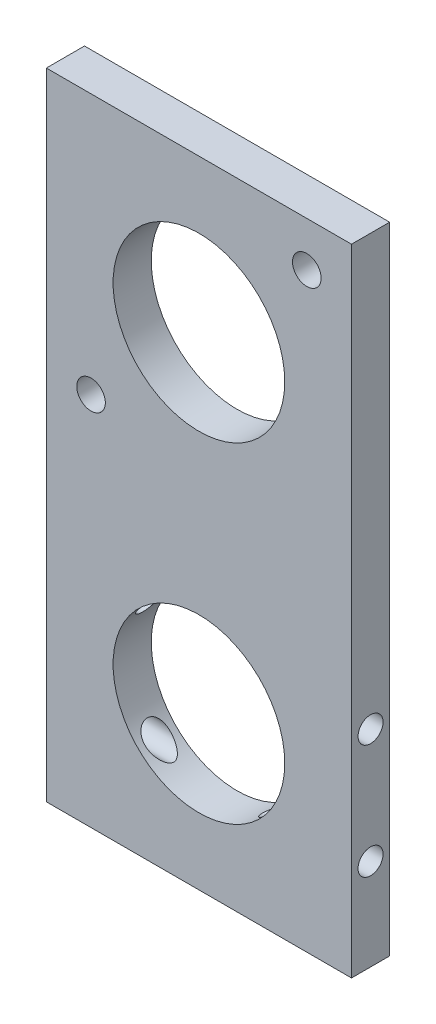
ISO-10303-21;
HEADER;
FILE_DESCRIPTION(('STEP AP214'),'2;1');
FILE_NAME('part.step','',(''),(''),'','','');
FILE_SCHEMA(('AUTOMOTIVE_DESIGN { 1 0 10303 214 1 1 1 1 }'));
ENDSEC;
DATA;
#1=APPLICATION_CONTEXT('core data for automotive mechanical design processes');
#2=APPLICATION_PROTOCOL_DEFINITION('international standard','automotive_design',2000,#1);
#3=PRODUCT_CONTEXT('',#1,'mechanical');
#4=PRODUCT('Part','Part','',(#3));
#5=PRODUCT_RELATED_PRODUCT_CATEGORY('part','',(#4));
#6=PRODUCT_DEFINITION_FORMATION('','',#4);
#7=PRODUCT_DEFINITION_CONTEXT('part definition',#1,'design');
#8=PRODUCT_DEFINITION('design','',#6,#7);
#9=PRODUCT_DEFINITION_SHAPE('','',#8);
#10=(LENGTH_UNIT() NAMED_UNIT(*) SI_UNIT(.MILLI.,.METRE.));
#11=(NAMED_UNIT(*) PLANE_ANGLE_UNIT() SI_UNIT($,.RADIAN.));
#12=(NAMED_UNIT(*) SI_UNIT($,.STERADIAN.) SOLID_ANGLE_UNIT());
#13=UNCERTAINTY_MEASURE_WITH_UNIT(LENGTH_MEASURE(1.E-05),#10,'distance_accuracy_value','');
#14=(GEOMETRIC_REPRESENTATION_CONTEXT(3) GLOBAL_UNCERTAINTY_ASSIGNED_CONTEXT((#13)) GLOBAL_UNIT_ASSIGNED_CONTEXT((#10,
#11,#12)) REPRESENTATION_CONTEXT('',''));
#15=CARTESIAN_POINT('',(0.,0.,0.));
#16=DIRECTION('',(0.,0.,1.));
#17=DIRECTION('',(1.,0.,0.));
#18=AXIS2_PLACEMENT_3D('',#15,#16,#17);
#19=CARTESIAN_POINT('',(0.,0.,6.35));
#20=DIRECTION('',(0.,0.,-1.));
#21=DIRECTION('',(-1.,0.,0.));
#22=AXIS2_PLACEMENT_3D('',#19,#20,#21);
#23=PLANE('',#22);
#24=DIRECTION('',(0.,-1.,0.));
#25=VECTOR('',#24,1.);
#26=CARTESIAN_POINT('',(-25.4,25.4,6.35));
#27=LINE('',#26,#25);
#28=CARTESIAN_POINT('',(-25.4,25.4,6.35));
#29=VERTEX_POINT('',#28);
#30=CARTESIAN_POINT('',(-25.4,-80.399998966,6.35));
#31=VERTEX_POINT('',#30);
#32=EDGE_CURVE('E94',#29,#31,#27,.T.);
#33=ORIENTED_EDGE('',*,*,#32,.T.);
#34=DIRECTION('',(1.,0.,0.));
#35=VECTOR('',#34,1.);
#36=CARTESIAN_POINT('',(25.4,-80.399998966,6.35));
#37=LINE('',#36,#35);
#38=CARTESIAN_POINT('',(25.4,-80.399998966,6.35));
#39=VERTEX_POINT('',#38);
#40=EDGE_CURVE('E89',#31,#39,#37,.T.);
#41=ORIENTED_EDGE('',*,*,#40,.T.);
#42=DIRECTION('',(0.,1.,0.));
#43=VECTOR('',#42,1.);
#44=CARTESIAN_POINT('',(25.4,25.4,6.35));
#45=LINE('',#44,#43);
#46=CARTESIAN_POINT('',(25.4,25.4,6.35));
#47=VERTEX_POINT('',#46);
#48=EDGE_CURVE('E92',#39,#47,#45,.T.);
#49=ORIENTED_EDGE('',*,*,#48,.T.);
#50=DIRECTION('',(-1.,0.,0.));
#51=VECTOR('',#50,1.);
#52=CARTESIAN_POINT('',(25.4,25.4,6.35));
#53=LINE('',#52,#51);
#54=EDGE_CURVE('E59',#47,#29,#53,.T.);
#55=ORIENTED_EDGE('',*,*,#54,.T.);
#56=EDGE_LOOP('',(#33,#41,#49,#55));
#57=FACE_BOUND('',#56,.T.);
#58=CARTESIAN_POINT('',(-17.9605122421383,-17.9605122421383,6.35));
#59=DIRECTION('',(0.,0.,1.));
#60=DIRECTION('',(1.,0.,0.));
#61=AXIS2_PLACEMENT_3D('',#58,#59,#60);
#62=CIRCLE('',#61,2.38125);
#63=CARTESIAN_POINT('',(-15.5792622421383,-17.9605122421383,6.35));
#64=VERTEX_POINT('',#63);
#65=EDGE_CURVE('E110',#64,#64,#62,.T.);
#66=ORIENTED_EDGE('',*,*,#65,.F.);
#67=EDGE_LOOP('',(#66));
#68=FACE_BOUND('',#67,.T.);
#69=CARTESIAN_POINT('',(0.,0.,6.35));
#70=DIRECTION('',(0.,0.,1.));
#71=DIRECTION('',(1.,0.,0.));
#72=AXIS2_PLACEMENT_3D('',#69,#70,#71);
#73=CIRCLE('',#72,14.2875);
#74=CARTESIAN_POINT('',(14.2875,0.,6.35));
#75=VERTEX_POINT('',#74);
#76=EDGE_CURVE('E180',#75,#75,#73,.T.);
#77=ORIENTED_EDGE('',*,*,#76,.F.);
#78=EDGE_LOOP('',(#77));
#79=FACE_BOUND('',#78,.T.);
#80=CARTESIAN_POINT('',(17.9605122421383,17.9605122421383,6.35));
#81=DIRECTION('',(0.,0.,1.));
#82=DIRECTION('',(1.,0.,0.));
#83=AXIS2_PLACEMENT_3D('',#80,#81,#82);
#84=CIRCLE('',#83,2.38125);
#85=CARTESIAN_POINT('',(20.3417622421383,17.9605122421383,6.35));
#86=VERTEX_POINT('',#85);
#87=EDGE_CURVE('E174',#86,#86,#84,.T.);
#88=ORIENTED_EDGE('',*,*,#87,.F.);
#89=EDGE_LOOP('',(#88));
#90=FACE_BOUND('',#89,.T.);
#91=CARTESIAN_POINT('',(0.,-54.999998966,6.35));
#92=DIRECTION('',(0.,0.,1.));
#93=DIRECTION('',(1.,0.,0.));
#94=AXIS2_PLACEMENT_3D('',#91,#92,#93);
#95=CIRCLE('',#94,14.2875);
#96=CARTESIAN_POINT('',(14.2875,-54.999998966,6.35));
#97=VERTEX_POINT('',#96);
#98=EDGE_CURVE('E165',#97,#97,#95,.T.);
#99=ORIENTED_EDGE('',*,*,#98,.F.);
#100=EDGE_LOOP('',(#99));
#101=FACE_BOUND('',#100,.T.);
#102=ADVANCED_FACE('F35',(#57,#68,#79,#90,#101),#23,.F.);
#103=CARTESIAN_POINT('',(0.,0.,0.));
#104=DIRECTION('',(0.,0.,-1.));
#105=DIRECTION('',(-1.,0.,0.));
#106=AXIS2_PLACEMENT_3D('',#103,#104,#105);
#107=PLANE('',#106);
#108=CARTESIAN_POINT('',(17.9605122421383,17.9605122421383,0.));
#109=DIRECTION('',(0.,0.,1.));
#110=DIRECTION('',(1.,0.,0.));
#111=AXIS2_PLACEMENT_3D('',#108,#109,#110);
#112=CIRCLE('',#111,2.38125);
#113=CARTESIAN_POINT('',(20.3417622421383,17.9605122421383,0.));
#114=VERTEX_POINT('',#113);
#115=EDGE_CURVE('E170',#114,#114,#112,.T.);
#116=ORIENTED_EDGE('',*,*,#115,.T.);
#117=EDGE_LOOP('',(#116));
#118=FACE_BOUND('',#117,.T.);
#119=CARTESIAN_POINT('',(-17.9605122421383,-17.9605122421383,0.));
#120=DIRECTION('',(0.,0.,1.));
#121=DIRECTION('',(1.,0.,0.));
#122=AXIS2_PLACEMENT_3D('',#119,#120,#121);
#123=CIRCLE('',#122,2.38125);
#124=CARTESIAN_POINT('',(-15.5792622421383,-17.9605122421383,0.));
#125=VERTEX_POINT('',#124);
#126=EDGE_CURVE('E183',#125,#125,#123,.T.);
#127=ORIENTED_EDGE('',*,*,#126,.T.);
#128=EDGE_LOOP('',(#127));
#129=FACE_BOUND('',#128,.T.);
#130=DIRECTION('',(0.,-1.,0.));
#131=VECTOR('',#130,1.);
#132=CARTESIAN_POINT('',(-25.4,25.4,0.));
#133=LINE('',#132,#131);
#134=CARTESIAN_POINT('',(-25.4,25.4,0.));
#135=VERTEX_POINT('',#134);
#136=CARTESIAN_POINT('',(-25.4,-80.399998966,0.));
#137=VERTEX_POINT('',#136);
#138=EDGE_CURVE('E107',#135,#137,#133,.T.);
#139=ORIENTED_EDGE('',*,*,#138,.F.);
#140=DIRECTION('',(-1.,0.,0.));
#141=VECTOR('',#140,1.);
#142=CARTESIAN_POINT('',(25.4,25.4,0.));
#143=LINE('',#142,#141);
#144=CARTESIAN_POINT('',(25.4,25.4,0.));
#145=VERTEX_POINT('',#144);
#146=EDGE_CURVE('E82',#145,#135,#143,.T.);
#147=ORIENTED_EDGE('',*,*,#146,.F.);
#148=DIRECTION('',(0.,1.,0.));
#149=VECTOR('',#148,1.);
#150=CARTESIAN_POINT('',(25.4,25.4,0.));
#151=LINE('',#150,#149);
#152=CARTESIAN_POINT('',(25.4,-80.399998966,0.));
#153=VERTEX_POINT('',#152);
#154=EDGE_CURVE('E76',#153,#145,#151,.T.);
#155=ORIENTED_EDGE('',*,*,#154,.F.);
#156=DIRECTION('',(1.,0.,0.));
#157=VECTOR('',#156,1.);
#158=CARTESIAN_POINT('',(25.4,-80.399998966,0.));
#159=LINE('',#158,#157);
#160=EDGE_CURVE('E98',#137,#153,#159,.T.);
#161=ORIENTED_EDGE('',*,*,#160,.F.);
#162=EDGE_LOOP('',(#139,#147,#155,#161));
#163=FACE_BOUND('',#162,.T.);
#164=CARTESIAN_POINT('',(0.,0.,0.));
#165=DIRECTION('',(0.,0.,1.));
#166=DIRECTION('',(1.,0.,0.));
#167=AXIS2_PLACEMENT_3D('',#164,#165,#166);
#168=CIRCLE('',#167,14.2875);
#169=CARTESIAN_POINT('',(14.2875,0.,0.));
#170=VERTEX_POINT('',#169);
#171=EDGE_CURVE('E177',#170,#170,#168,.T.);
#172=ORIENTED_EDGE('',*,*,#171,.T.);
#173=EDGE_LOOP('',(#172));
#174=FACE_BOUND('',#173,.T.);
#175=CARTESIAN_POINT('',(0.,-54.999998966,0.));
#176=DIRECTION('',(0.,0.,1.));
#177=DIRECTION('',(1.,0.,0.));
#178=AXIS2_PLACEMENT_3D('',#175,#176,#177);
#179=CIRCLE('',#178,14.2875);
#180=CARTESIAN_POINT('',(14.2875,-54.999998966,0.));
#181=VERTEX_POINT('',#180);
#182=EDGE_CURVE('E150',#181,#181,#179,.T.);
#183=ORIENTED_EDGE('',*,*,#182,.T.);
#184=EDGE_LOOP('',(#183));
#185=FACE_BOUND('',#184,.T.);
#186=ADVANCED_FACE('F191',(#118,#129,#163,#174,#185),#107,.T.);
#187=CARTESIAN_POINT('',(-25.4,25.4,6.35));
#188=DIRECTION('',(1.,0.,0.));
#189=DIRECTION('',(0.,1.,0.));
#190=AXIS2_PLACEMENT_3D('',#187,#188,#189);
#191=PLANE('',#190);
#192=CARTESIAN_POINT('',(-25.4,-65.159998966,3.175));
#193=DIRECTION('',(1.,0.,0.));
#194=DIRECTION('',(0.,1.,0.));
#195=AXIS2_PLACEMENT_3D('',#192,#193,#194);
#196=CIRCLE('',#195,2.0828);
#197=CARTESIAN_POINT('',(-25.4,-63.077198966,3.175));
#198=VERTEX_POINT('',#197);
#199=EDGE_CURVE('E124',#198,#198,#196,.T.);
#200=ORIENTED_EDGE('',*,*,#199,.T.);
#201=EDGE_LOOP('',(#200));
#202=FACE_BOUND('',#201,.T.);
#203=CARTESIAN_POINT('',(-25.4,-46.109998966,3.175));
#204=DIRECTION('',(1.,0.,0.));
#205=DIRECTION('',(0.,1.,0.));
#206=AXIS2_PLACEMENT_3D('',#203,#204,#205);
#207=CIRCLE('',#206,2.0828);
#208=CARTESIAN_POINT('',(-25.4,-44.027198966,3.175));
#209=VERTEX_POINT('',#208);
#210=EDGE_CURVE('E230',#209,#209,#207,.T.);
#211=ORIENTED_EDGE('',*,*,#210,.T.);
#212=EDGE_LOOP('',(#211));
#213=FACE_BOUND('',#212,.T.);
#214=ORIENTED_EDGE('',*,*,#138,.T.);
#215=DIRECTION('',(0.,0.,-1.));
#216=VECTOR('',#215,1.);
#217=CARTESIAN_POINT('',(-25.4,-80.399998966,6.35));
#218=LINE('',#217,#216);
#219=EDGE_CURVE('E11',#31,#137,#218,.T.);
#220=ORIENTED_EDGE('',*,*,#219,.F.);
#221=ORIENTED_EDGE('',*,*,#32,.F.);
#222=DIRECTION('',(0.,0.,-1.));
#223=VECTOR('',#222,1.);
#224=CARTESIAN_POINT('',(-25.4,25.4,6.35));
#225=LINE('',#224,#223);
#226=EDGE_CURVE('E103',#29,#135,#225,.T.);
#227=ORIENTED_EDGE('',*,*,#226,.T.);
#228=EDGE_LOOP('',(#214,#220,#221,#227));
#229=FACE_BOUND('',#228,.T.);
#230=ADVANCED_FACE('F37',(#202,#213,#229),#191,.F.);
#231=CARTESIAN_POINT('',(25.4,-80.399998966,6.35));
#232=DIRECTION('',(0.,1.,0.));
#233=DIRECTION('',(0.,0.,1.));
#234=AXIS2_PLACEMENT_3D('',#231,#232,#233);
#235=PLANE('',#234);
#236=ORIENTED_EDGE('',*,*,#160,.T.);
#237=DIRECTION('',(0.,0.,-1.));
#238=VECTOR('',#237,1.);
#239=CARTESIAN_POINT('',(25.4,-80.399998966,6.35));
#240=LINE('',#239,#238);
#241=EDGE_CURVE('E50',#39,#153,#240,.T.);
#242=ORIENTED_EDGE('',*,*,#241,.F.);
#243=ORIENTED_EDGE('',*,*,#40,.F.);
#244=ORIENTED_EDGE('',*,*,#219,.T.);
#245=EDGE_LOOP('',(#236,#242,#243,#244));
#246=FACE_BOUND('',#245,.T.);
#247=ADVANCED_FACE('F97',(#246),#235,.F.);
#248=CARTESIAN_POINT('',(25.4,25.4,6.35));
#249=DIRECTION('',(-1.,0.,0.));
#250=DIRECTION('',(0.,-1.,0.));
#251=AXIS2_PLACEMENT_3D('',#248,#249,#250);
#252=PLANE('',#251);
#253=CARTESIAN_POINT('',(25.4,-65.159998966,3.175));
#254=DIRECTION('',(1.,0.,0.));
#255=DIRECTION('',(0.,1.,0.));
#256=AXIS2_PLACEMENT_3D('',#253,#254,#255);
#257=CIRCLE('',#256,2.0828);
#258=CARTESIAN_POINT('',(25.4,-63.077198966,3.175));
#259=VERTEX_POINT('',#258);
#260=EDGE_CURVE('E235',#259,#259,#257,.T.);
#261=ORIENTED_EDGE('',*,*,#260,.F.);
#262=EDGE_LOOP('',(#261));
#263=FACE_BOUND('',#262,.T.);
#264=CARTESIAN_POINT('',(25.4,-46.109998966,3.175));
#265=DIRECTION('',(1.,0.,0.));
#266=DIRECTION('',(0.,1.,0.));
#267=AXIS2_PLACEMENT_3D('',#264,#265,#266);
#268=CIRCLE('',#267,2.0828);
#269=CARTESIAN_POINT('',(25.4,-44.027198966,3.175));
#270=VERTEX_POINT('',#269);
#271=EDGE_CURVE('E236',#270,#270,#268,.T.);
#272=ORIENTED_EDGE('',*,*,#271,.F.);
#273=EDGE_LOOP('',(#272));
#274=FACE_BOUND('',#273,.T.);
#275=ORIENTED_EDGE('',*,*,#154,.T.);
#276=DIRECTION('',(0.,0.,-1.));
#277=VECTOR('',#276,1.);
#278=CARTESIAN_POINT('',(25.4,25.4,6.35));
#279=LINE('',#278,#277);
#280=EDGE_CURVE('E99',#47,#145,#279,.T.);
#281=ORIENTED_EDGE('',*,*,#280,.F.);
#282=ORIENTED_EDGE('',*,*,#48,.F.);
#283=ORIENTED_EDGE('',*,*,#241,.T.);
#284=EDGE_LOOP('',(#275,#281,#282,#283));
#285=FACE_BOUND('',#284,.T.);
#286=ADVANCED_FACE('F101',(#263,#274,#285),#252,.F.);
#287=CARTESIAN_POINT('',(25.4,25.4,6.35));
#288=DIRECTION('',(0.,-1.,0.));
#289=DIRECTION('',(1.,0.,0.));
#290=AXIS2_PLACEMENT_3D('',#287,#288,#289);
#291=PLANE('',#290);
#292=ORIENTED_EDGE('',*,*,#146,.T.);
#293=ORIENTED_EDGE('',*,*,#226,.F.);
#294=ORIENTED_EDGE('',*,*,#54,.F.);
#295=ORIENTED_EDGE('',*,*,#280,.T.);
#296=EDGE_LOOP('',(#292,#293,#294,#295));
#297=FACE_BOUND('',#296,.T.);
#298=ADVANCED_FACE('F197',(#297),#291,.F.);
#299=CARTESIAN_POINT('',(-17.9605122421383,-17.9605122421383,6.35));
#300=DIRECTION('',(0.,0.,-1.));
#301=DIRECTION('',(-1.,0.,0.));
#302=AXIS2_PLACEMENT_3D('',#299,#300,#301);
#303=CYLINDRICAL_SURFACE('',#302,2.38125);
#304=ORIENTED_EDGE('',*,*,#65,.T.);
#305=EDGE_LOOP('',(#304));
#306=FACE_BOUND('',#305,.T.);
#307=ORIENTED_EDGE('',*,*,#126,.F.);
#308=EDGE_LOOP('',(#307));
#309=FACE_BOUND('',#308,.T.);
#310=ADVANCED_FACE('F194',(#306,#309),#303,.F.);
#311=CARTESIAN_POINT('',(0.,0.,6.35));
#312=DIRECTION('',(0.,0.,-1.));
#313=DIRECTION('',(-1.,0.,0.));
#314=AXIS2_PLACEMENT_3D('',#311,#312,#313);
#315=CYLINDRICAL_SURFACE('',#314,14.2875);
#316=ORIENTED_EDGE('',*,*,#76,.T.);
#317=EDGE_LOOP('',(#316));
#318=FACE_BOUND('',#317,.T.);
#319=ORIENTED_EDGE('',*,*,#171,.F.);
#320=EDGE_LOOP('',(#319));
#321=FACE_BOUND('',#320,.T.);
#322=ADVANCED_FACE('F196',(#318,#321),#315,.F.);
#323=CARTESIAN_POINT('',(17.9605122421383,17.9605122421383,6.35));
#324=DIRECTION('',(0.,0.,-1.));
#325=DIRECTION('',(-1.,0.,0.));
#326=AXIS2_PLACEMENT_3D('',#323,#324,#325);
#327=CYLINDRICAL_SURFACE('',#326,2.38125);
#328=ORIENTED_EDGE('',*,*,#87,.T.);
#329=EDGE_LOOP('',(#328));
#330=FACE_BOUND('',#329,.T.);
#331=ORIENTED_EDGE('',*,*,#115,.F.);
#332=EDGE_LOOP('',(#331));
#333=FACE_BOUND('',#332,.T.);
#334=ADVANCED_FACE('F158',(#330,#333),#327,.F.);
#335=CARTESIAN_POINT('',(0.,-54.999998966,6.35));
#336=DIRECTION('',(0.,0.,-1.));
#337=DIRECTION('',(-1.,0.,0.));
#338=AXIS2_PLACEMENT_3D('',#335,#336,#337);
#339=CYLINDRICAL_SURFACE('',#338,14.2875);
#340=CARTESIAN_POINT('',(-11.7852236470081,-63.077198966,3.175));
#341=CARTESIAN_POINT('',(-11.7852200210865,-63.0772061202286,3.27602967904974));
#342=CARTESIAN_POINT('',(-11.7801646655475,-63.0845957641341,3.37712905830519));
#343=CARTESIAN_POINT('',(-11.7601115695198,-63.1137360248958,3.5762709852243));
#344=CARTESIAN_POINT('',(-11.7451036211026,-63.1355013861888,3.67431028609033));
#345=CARTESIAN_POINT('',(-11.7057345254466,-63.192044289194,3.86419652589845));
#346=CARTESIAN_POINT('',(-11.6814033944205,-63.2267800632834,3.95606223659754));
#347=CARTESIAN_POINT('',(-11.6241739829658,-63.3074456435918,4.13179622119825));
#348=CARTESIAN_POINT('',(-11.5912758432201,-63.3533752659907,4.21566462639634));
#349=CARTESIAN_POINT('',(-11.5160108307966,-63.4568557224404,4.37794434711993));
#350=CARTESIAN_POINT('',(-11.4732540769725,-63.5148713023968,4.45587606548645));
#351=CARTESIAN_POINT('',(-11.3804677589648,-63.6384943242396,4.60053543709756));
#352=CARTESIAN_POINT('',(-11.3304343067992,-63.7041058208212,4.66725705938827));
#353=CARTESIAN_POINT('',(-11.2021640350763,-63.8689925913797,4.8145466212034));
#354=CARTESIAN_POINT('',(-11.1208244043545,-63.9709624817474,4.88941785188982));
#355=CARTESIAN_POINT('',(-10.9485558745201,-64.1804287715483,5.0171772409277));
#356=CARTESIAN_POINT('',(-10.8576094962387,-64.2879350556812,5.07002443262991));
#357=CARTESIAN_POINT('',(-10.6388035322822,-64.5385553535987,5.16880468225298));
#358=CARTESIAN_POINT('',(-10.5083134419513,-64.6822611015666,5.20736950824455));
#359=CARTESIAN_POINT('',(-10.2389398173101,-64.9667090071064,5.25382802491593));
#360=CARTESIAN_POINT('',(-10.1000449758161,-65.1074468126519,5.26167942043348));
#361=CARTESIAN_POINT('',(-9.86890837289175,-65.3321357745951,5.25250809263101));
#362=CARTESIAN_POINT('',(-9.77814307623635,-65.4180637821556,5.24351862114927));
#363=CARTESIAN_POINT('',(-9.59524713679069,-65.5867520890157,5.2154043217988));
#364=CARTESIAN_POINT('',(-9.50311661101698,-65.6695126576492,5.19628035774935));
#365=CARTESIAN_POINT('',(-9.31805164399701,-65.8315143329004,5.14839030979613));
#366=CARTESIAN_POINT('',(-9.22511624710722,-65.9107502760037,5.11961057519781));
#367=CARTESIAN_POINT('',(-9.03929446608978,-66.0651873698356,5.05270377933805));
#368=CARTESIAN_POINT('',(-8.94640807557254,-66.1403896905116,5.01457944653189));
#369=CARTESIAN_POINT('',(-8.77955370053708,-66.2721366413259,4.93733976630736));
#370=CARTESIAN_POINT('',(-8.7054325129998,-66.3294575589607,4.89987089862277));
#371=CARTESIAN_POINT('',(-8.55828919926966,-66.441015503017,4.81871856859572));
#372=CARTESIAN_POINT('',(-8.48526684706636,-66.4952531701625,4.77503640408209));
#373=CARTESIAN_POINT('',(-8.34120274130817,-66.6002106861735,4.68124952742697));
#374=CARTESIAN_POINT('',(-8.2701561252153,-66.6509397339091,4.63116267327067));
#375=CARTESIAN_POINT('',(-8.13084652329284,-66.7485824912177,4.52396718047852));
#376=CARTESIAN_POINT('',(-8.06258157281333,-66.7954989177213,4.46686361626136));
#377=CARTESIAN_POINT('',(-7.92993354812477,-66.8850835756816,4.34457801539588));
#378=CARTESIAN_POINT('',(-7.86556732368504,-66.9277338235784,4.279364183057));
#379=CARTESIAN_POINT('',(-7.74324201273182,-67.0075037383609,4.13999943724699));
#380=CARTESIAN_POINT('',(-7.68528005065752,-67.0446258900277,4.06585256629499));
#381=CARTESIAN_POINT('',(-7.58941079313738,-67.105208081159,3.92269788923124));
#382=CARTESIAN_POINT('',(-7.54978582872227,-67.1299237461775,3.85539374954056));
#383=CARTESIAN_POINT('',(-7.47991064988279,-67.173136724309,3.71421122336098));
#384=CARTESIAN_POINT('',(-7.44964144692971,-67.1916466392207,3.64034654994439));
#385=CARTESIAN_POINT('',(-7.40721237153336,-67.217459335049,3.50446897874408));
#386=CARTESIAN_POINT('',(-7.39250267409781,-67.2263515347495,3.44356570637847));
#387=CARTESIAN_POINT('',(-7.37205515378216,-67.2386920161568,3.3197382978064));
#388=CARTESIAN_POINT('',(-7.36630835190733,-67.2421457461354,3.256816248598));
#389=CARTESIAN_POINT('',(-7.36441686622698,-67.2432837636755,3.13064229763926));
#390=CARTESIAN_POINT('',(-7.36829168163856,-67.2409563351094,3.06738998571347));
#391=CARTESIAN_POINT('',(-7.38523515588226,-67.2307409830152,2.94258709463043));
#392=CARTESIAN_POINT('',(-7.39831184174227,-67.2228482046773,2.88103805003314));
#393=CARTESIAN_POINT('',(-7.43679505486891,-67.1994807132282,2.74553078489217));
#394=CARTESIAN_POINT('',(-7.46451785584844,-67.1825717080963,2.67248750628224));
#395=CARTESIAN_POINT('',(-7.52938973402053,-67.1425852201885,2.53255621306915));
#396=CARTESIAN_POINT('',(-7.56655869051615,-67.1194947230092,2.46568158993725));
#397=CARTESIAN_POINT('',(-7.6710284445789,-67.0537794274481,2.30125751931205));
#398=CARTESIAN_POINT('',(-7.74331922360055,-67.0075828043981,2.20835122917415));
#399=CARTESIAN_POINT('',(-7.89752421549738,-66.9067338905831,2.03615687839956));
#400=CARTESIAN_POINT('',(-7.97946434959118,-66.8520586930051,1.95690697581904));
#401=CARTESIAN_POINT('',(-8.13635536938147,-66.7447866023788,1.82118781158848));
#402=CARTESIAN_POINT('',(-8.21053087823509,-66.6930919462581,1.76308354888738));
#403=CARTESIAN_POINT('',(-8.36155582012107,-66.5855779297464,1.65459932946992));
#404=CARTESIAN_POINT('',(-8.43840700130724,-66.5297558448834,1.60422454358429));
#405=CARTESIAN_POINT('',(-8.59378977860668,-66.4144112344979,1.51066191223892));
#406=CARTESIAN_POINT('',(-8.67232272797948,-66.3548856494383,1.46748012031237));
#407=CARTESIAN_POINT('',(-8.83028597245094,-66.23248295031,1.38805946113391));
#408=CARTESIAN_POINT('',(-8.90971638412696,-66.1696053967943,1.35182150710296));
#409=CARTESIAN_POINT('',(-9.07314859531223,-66.037310843421,1.28445026217103));
#410=CARTESIAN_POINT('',(-9.15716827358787,-65.9677239245075,1.25369228116206));
#411=CARTESIAN_POINT('',(-9.32498636729342,-65.8254056053217,1.19988542963598));
#412=CARTESIAN_POINT('',(-9.40878475357644,-65.7526738108024,1.17683752885015));
#413=CARTESIAN_POINT('',(-9.65894203987941,-65.5302887687969,1.11967324176174));
#414=CARTESIAN_POINT('',(-9.82435279881834,-65.3762123900095,1.09741679328825));
#415=CARTESIAN_POINT('',(-10.1236984343917,-65.0836728702183,1.0892643421575));
#416=CARTESIAN_POINT('',(-10.2586232990871,-64.9463507077387,1.09839933669844));
#417=CARTESIAN_POINT('',(-10.520428161798,-64.6689893296187,1.14603362234142));
#418=CARTESIAN_POINT('',(-10.647317589607,-64.5289535604481,1.18449777637111));
#419=CARTESIAN_POINT('',(-10.8607714176662,-64.2841920197262,1.28183845452185));
#420=CARTESIAN_POINT('',(-10.9498126123361,-64.17888941421,1.3338096325662));
#421=CARTESIAN_POINT('',(-11.1186837516055,-63.9735764902089,1.45894025131487));
#422=CARTESIAN_POINT('',(-11.1985261805432,-63.8735591010516,1.53207049032042));
#423=CARTESIAN_POINT('',(-11.3325992889651,-63.7014064141979,1.68462768407746));
#424=CARTESIAN_POINT('',(-11.3888298534549,-63.6275490471228,1.76033983721771));
#425=CARTESIAN_POINT('',(-11.4919060499563,-63.4897661258315,1.92600731284729));
#426=CARTESIAN_POINT('',(-11.5387517569073,-63.42584049231,2.01596252159349));
#427=CARTESIAN_POINT('',(-11.6217499327717,-63.3109966698791,2.20961230442199));
#428=CARTESIAN_POINT('',(-11.6578132380185,-63.2601873915382,2.31341170194378));
#429=CARTESIAN_POINT('',(-11.702283497882,-63.1969420960733,2.47651376763694));
#430=CARTESIAN_POINT('',(-11.7155003154065,-63.1780254452704,2.53209742731728));
#431=CARTESIAN_POINT('',(-11.7386078560327,-63.14482257132,2.64529184422148));
#432=CARTESIAN_POINT('',(-11.7485001218647,-63.1305342005699,2.70290164748256));
#433=CARTESIAN_POINT('',(-11.7661316384559,-63.1050026758823,2.82887490706306));
#434=CARTESIAN_POINT('',(-11.7732806544066,-63.094601812151,2.89749486766827));
#435=CARTESIAN_POINT('',(-11.782827659066,-63.080697853337,3.03573224682428));
#436=CARTESIAN_POINT('',(-11.7852261467393,-63.0771940338338,3.10534955984593));
#437=CARTESIAN_POINT('',(-11.7852236470081,-63.077198966,3.175));
#438=B_SPLINE_CURVE_WITH_KNOTS('',3,(#340,#341,#342,#343,#344,#345,#346,#347,#348,#349,#350,
#351,#352,#353,#354,#355,#356,#357,#358,#359,#360,#361,#362,#363,#364,#365,#366,#367,#368,#369,
#370,#371,#372,#373,#374,#375,#376,#377,#378,#379,#380,#381,#382,#383,#384,#385,#386,#387,#388,
#389,#390,#391,#392,#393,#394,#395,#396,#397,#398,#399,#400,#401,#402,#403,#404,#405,#406,#407,
#408,#409,#410,#411,#412,#413,#414,#415,#416,#417,#418,#419,#420,#421,#422,#423,#424,#425,#426,
#427,#428,#429,#430,#431,#432,#433,#434,#435,#436,#437),.UNSPECIFIED.,.T.,.F.,(4,2,2,2,2,2,2,2,
2,2,2,2,2,2,2,2,2,2,2,2,2,2,2,2,2,2,2,2,2,2,2,2,2,2,2,2,2,2,2,2,2,2,2,2,2,2,2,2,4),(0.,
0.302822882057644,0.605956837345417,0.908122935991352,1.21028407294396,1.52748926998896,
1.84486457853834,2.29358161927353,2.74312962748938,3.33368623936297,3.92505581522874,
4.30056929783117,4.6760507784735,5.0520653427947,5.42797024811205,5.73048950159227,
6.0329456576186,6.33457615958717,6.63598979506337,6.93862473036334,7.24112322336332,
7.48610255252897,7.73058135427422,7.91963337805558,8.10849588830665,8.29774146051276,
8.48715232146738,8.7256220256251,8.96459780290731,9.34186266822414,9.7201651540023,
10.0421522194956,10.3643537560449,10.6868250981572,11.0093388211229,11.349052713098,
11.6888093163577,12.3671610074305,12.9434008756169,13.5189514764677,13.9594832002253,
14.3994098211073,14.7573316742172,15.1152506691558,15.4760523934211,15.6563466946597,
15.8365572159564,16.0453469786543,16.2541148102699),.UNSPECIFIED.);
#439=CARTESIAN_POINT('',(-11.7852236470081,-63.077198966,3.175));
#440=VERTEX_POINT('',#439);
#441=EDGE_CURVE('E39',#440,#440,#438,.T.);
#442=ORIENTED_EDGE('',*,*,#441,.F.);
#443=EDGE_LOOP('',(#442));
#444=FACE_BOUND('',#443,.T.);
#445=CARTESIAN_POINT('',(11.7852236470081,-63.077198966,3.175));
#446=CARTESIAN_POINT('',(11.7852200210865,-63.0772061202286,3.07397032095025));
#447=CARTESIAN_POINT('',(11.7801646655475,-63.0845957641341,2.97287094169481));
#448=CARTESIAN_POINT('',(11.7601115695198,-63.1137360248958,2.77372901477569));
#449=CARTESIAN_POINT('',(11.7451036211026,-63.1355013861888,2.67568971390967));
#450=CARTESIAN_POINT('',(11.7057345254466,-63.192044289194,2.48580347410154));
#451=CARTESIAN_POINT('',(11.6814033944205,-63.2267800632834,2.39393776340246));
#452=CARTESIAN_POINT('',(11.6241739829658,-63.3074456435918,2.21820377880175));
#453=CARTESIAN_POINT('',(11.5912758432201,-63.3533752659907,2.13433537360365));
#454=CARTESIAN_POINT('',(11.5160108307966,-63.4568557224404,1.97205565288006));
#455=CARTESIAN_POINT('',(11.4732540769725,-63.5148713023968,1.89412393451354));
#456=CARTESIAN_POINT('',(11.3804677589648,-63.6384943242396,1.74946456290244));
#457=CARTESIAN_POINT('',(11.3304343067992,-63.7041058208212,1.68274294061172));
#458=CARTESIAN_POINT('',(11.2021640350763,-63.8689925913797,1.5354533787966));
#459=CARTESIAN_POINT('',(11.1208244043545,-63.9709624817474,1.46058214811018));
#460=CARTESIAN_POINT('',(10.9485558745201,-64.1804287715483,1.3328227590723));
#461=CARTESIAN_POINT('',(10.8576094962387,-64.2879350556812,1.27997556737009));
#462=CARTESIAN_POINT('',(10.6388035322822,-64.5385553535987,1.18119531774702));
#463=CARTESIAN_POINT('',(10.5083134419513,-64.6822611015666,1.14263049175545));
#464=CARTESIAN_POINT('',(10.2389398173101,-64.9667090071064,1.09617197508407));
#465=CARTESIAN_POINT('',(10.1000449758161,-65.1074468126519,1.08832057956652));
#466=CARTESIAN_POINT('',(9.86890837289175,-65.3321357745951,1.09749190736899));
#467=CARTESIAN_POINT('',(9.77814307623635,-65.4180637821556,1.10648137885073));
#468=CARTESIAN_POINT('',(9.59524713679069,-65.5867520890157,1.13459567820121));
#469=CARTESIAN_POINT('',(9.50311661101698,-65.6695126576492,1.15371964225065));
#470=CARTESIAN_POINT('',(9.318051643997,-65.8315143329004,1.20160969020387));
#471=CARTESIAN_POINT('',(9.22511624710721,-65.9107502760037,1.2303894248022));
#472=CARTESIAN_POINT('',(9.03929446608977,-66.0651873698356,1.29729622066195));
#473=CARTESIAN_POINT('',(8.94640807557254,-66.1403896905116,1.33542055346811));
#474=CARTESIAN_POINT('',(8.77955370053707,-66.2721366413259,1.41266023369264));
#475=CARTESIAN_POINT('',(8.7054325129998,-66.3294575589607,1.45012910137724));
#476=CARTESIAN_POINT('',(8.55828919926966,-66.441015503017,1.53128143140429));
#477=CARTESIAN_POINT('',(8.48526684706636,-66.4952531701625,1.57496359591791));
#478=CARTESIAN_POINT('',(8.34120274130818,-66.6002106861735,1.66875047257303));
#479=CARTESIAN_POINT('',(8.2701561252153,-66.6509397339091,1.71883732672933));
#480=CARTESIAN_POINT('',(8.13084652329284,-66.7485824912177,1.82603281952148));
#481=CARTESIAN_POINT('',(8.06258157281333,-66.7954989177213,1.88313638373864));
#482=CARTESIAN_POINT('',(7.92993354812477,-66.8850835756816,2.00542198460412));
#483=CARTESIAN_POINT('',(7.86556732368504,-66.9277338235784,2.070635816943));
#484=CARTESIAN_POINT('',(7.74324201273182,-67.0075037383609,2.21000056275301));
#485=CARTESIAN_POINT('',(7.68528005065751,-67.0446258900277,2.28414743370501));
#486=CARTESIAN_POINT('',(7.58941079313739,-67.105208081159,2.42730211076877));
#487=CARTESIAN_POINT('',(7.54978582872227,-67.1299237461775,2.49460625045944));
#488=CARTESIAN_POINT('',(7.4799106498828,-67.173136724309,2.63578877663902));
#489=CARTESIAN_POINT('',(7.44964144692971,-67.1916466392207,2.70965345005562));
#490=CARTESIAN_POINT('',(7.40721237153337,-67.217459335049,2.84553102125592));
#491=CARTESIAN_POINT('',(7.39250267409781,-67.2263515347495,2.90643429362153));
#492=CARTESIAN_POINT('',(7.37205515378217,-67.2386920161568,3.03026170219361));
#493=CARTESIAN_POINT('',(7.36630835190734,-67.2421457461354,3.093183751402));
#494=CARTESIAN_POINT('',(7.36441686622698,-67.2432837636755,3.21935770236075));
#495=CARTESIAN_POINT('',(7.36829168163856,-67.2409563351094,3.28261001428653));
#496=CARTESIAN_POINT('',(7.38523515588226,-67.2307409830152,3.40741290536957));
#497=CARTESIAN_POINT('',(7.39831184174227,-67.2228482046773,3.46896194996686));
#498=CARTESIAN_POINT('',(7.43679505486891,-67.1994807132282,3.60446921510783));
#499=CARTESIAN_POINT('',(7.46451785584844,-67.1825717080963,3.67751249371776));
#500=CARTESIAN_POINT('',(7.52938973402054,-67.1425852201885,3.81744378693085));
#501=CARTESIAN_POINT('',(7.56655869051615,-67.1194947230092,3.88431841006275));
#502=CARTESIAN_POINT('',(7.67102844457891,-67.0537794274481,4.04874248068795));
#503=CARTESIAN_POINT('',(7.74331922360055,-67.007582804398,4.14164877082586));
#504=CARTESIAN_POINT('',(7.89752421549739,-66.9067338905831,4.31384312160044));
#505=CARTESIAN_POINT('',(7.97946434959119,-66.8520586930051,4.39309302418096));
#506=CARTESIAN_POINT('',(8.13635536938148,-66.7447866023788,4.52881218841152));
#507=CARTESIAN_POINT('',(8.2105308782351,-66.6930919462581,4.58691645111263));
#508=CARTESIAN_POINT('',(8.36155582012109,-66.5855779297464,4.69540067053009));
#509=CARTESIAN_POINT('',(8.43840700130726,-66.5297558448834,4.74577545641572));
#510=CARTESIAN_POINT('',(8.5937897786067,-66.4144112344979,4.83933808776108));
#511=CARTESIAN_POINT('',(8.6723227279795,-66.3548856494383,4.88251987968764));
#512=CARTESIAN_POINT('',(8.83028597245096,-66.23248295031,4.9619405388661));
#513=CARTESIAN_POINT('',(8.90971638412698,-66.1696053967943,4.99817849289705));
#514=CARTESIAN_POINT('',(9.07314859531225,-66.037310843421,5.06554973782897));
#515=CARTESIAN_POINT('',(9.15716827358789,-65.9677239245075,5.09630771883794));
#516=CARTESIAN_POINT('',(9.32498636729344,-65.8254056053217,5.15011457036402));
#517=CARTESIAN_POINT('',(9.40878475357646,-65.7526738108024,5.17316247114986));
#518=CARTESIAN_POINT('',(9.65894203987943,-65.5302887687969,5.23032675823826));
#519=CARTESIAN_POINT('',(9.82435279881836,-65.3762123900095,5.25258320671175));
#520=CARTESIAN_POINT('',(10.1236984343917,-65.0836728702182,5.2607356578425));
#521=CARTESIAN_POINT('',(10.2586232990872,-64.9463507077386,5.25160066330156));
#522=CARTESIAN_POINT('',(10.520428161798,-64.6689893296187,5.20396637765857));
#523=CARTESIAN_POINT('',(10.647317589607,-64.5289535604481,5.16550222362889));
#524=CARTESIAN_POINT('',(10.8607714176663,-64.2841920197262,5.06816154547815));
#525=CARTESIAN_POINT('',(10.9498126123361,-64.17888941421,5.01619036743379));
#526=CARTESIAN_POINT('',(11.1186837516056,-63.9735764902089,4.89105974868513));
#527=CARTESIAN_POINT('',(11.1985261805432,-63.8735591010516,4.81792950967957));
#528=CARTESIAN_POINT('',(11.3325992889651,-63.7014064141979,4.66537231592254));
#529=CARTESIAN_POINT('',(11.388829853455,-63.6275490471228,4.58966016278228));
#530=CARTESIAN_POINT('',(11.4919060499564,-63.4897661258315,4.42399268715271));
#531=CARTESIAN_POINT('',(11.5387517569073,-63.42584049231,4.3340374784065));
#532=CARTESIAN_POINT('',(11.6217499327717,-63.3109966698791,4.140387695578));
#533=CARTESIAN_POINT('',(11.6578132380186,-63.2601873915382,4.03658829805622));
#534=CARTESIAN_POINT('',(11.702283497882,-63.1969420960733,3.87348623236305));
#535=CARTESIAN_POINT('',(11.7155003154065,-63.1780254452704,3.81790257268272));
#536=CARTESIAN_POINT('',(11.7386078560327,-63.14482257132,3.70470815577851));
#537=CARTESIAN_POINT('',(11.7485001218647,-63.1305342005699,3.64709835251743));
#538=CARTESIAN_POINT('',(11.7661316384559,-63.1050026758823,3.52112509293693));
#539=CARTESIAN_POINT('',(11.7732806544066,-63.094601812151,3.45250513233173));
#540=CARTESIAN_POINT('',(11.782827659066,-63.080697853337,3.31426775317572));
#541=CARTESIAN_POINT('',(11.7852261467393,-63.0771940338338,3.24465044015407));
#542=CARTESIAN_POINT('',(11.7852236470081,-63.077198966,3.175));
#543=B_SPLINE_CURVE_WITH_KNOTS('',3,(#445,#446,#447,#448,#449,#450,#451,#452,#453,#454,#455,
#456,#457,#458,#459,#460,#461,#462,#463,#464,#465,#466,#467,#468,#469,#470,#471,#472,#473,#474,
#475,#476,#477,#478,#479,#480,#481,#482,#483,#484,#485,#486,#487,#488,#489,#490,#491,#492,#493,
#494,#495,#496,#497,#498,#499,#500,#501,#502,#503,#504,#505,#506,#507,#508,#509,#510,#511,#512,
#513,#514,#515,#516,#517,#518,#519,#520,#521,#522,#523,#524,#525,#526,#527,#528,#529,#530,#531,
#532,#533,#534,#535,#536,#537,#538,#539,#540,#541,#542),.UNSPECIFIED.,.T.,.F.,(4,2,2,2,2,2,2,2,
2,2,2,2,2,2,2,2,2,2,2,2,2,2,2,2,2,2,2,2,2,2,2,2,2,2,2,2,2,2,2,2,2,2,2,2,2,2,2,2,4),(0.,
0.302822882057645,0.605956837345421,0.908122935991359,1.21028407294397,1.52748926998897,
1.84486457853835,2.29358161927354,2.74312962748938,3.33368623936298,3.92505581522875,
4.30056929783118,4.67605077847351,5.05206534279471,5.42797024811206,5.73048950159228,
6.0329456576186,6.33457615958717,6.63598979506338,6.93862473036335,7.24112322336333,
7.48610255252898,7.73058135427422,7.91963337805559,8.10849588830665,8.29774146051277,
8.48715232146739,8.7256220256251,8.96459780290731,9.34186266822416,9.72016515400231,
10.0421522194956,10.3643537560449,10.6868250981573,11.009338821123,11.349052713098,
11.6888093163577,12.3671610074305,12.943400875617,13.5189514764677,13.9594832002253,
14.3994098211073,14.7573316742172,15.1152506691558,15.4760523934211,15.6563466946597,
15.8365572159565,16.0453469786543,16.2541148102699),.UNSPECIFIED.);
#544=CARTESIAN_POINT('',(11.7852236470081,-63.077198966,3.175));
#545=VERTEX_POINT('',#544);
#546=EDGE_CURVE('E143',#545,#545,#543,.T.);
#547=ORIENTED_EDGE('',*,*,#546,.F.);
#548=EDGE_LOOP('',(#547));
#549=FACE_BOUND('',#548,.T.);
#550=CARTESIAN_POINT('',(-9.15042711626076,-44.027198966,3.175));
#551=CARTESIAN_POINT('',(-9.15043989269988,-44.0272081901678,3.26454890008489));
#552=CARTESIAN_POINT('',(-9.1574512470247,-44.0330448509167,3.35424979131611));
#553=CARTESIAN_POINT('',(-9.1846193028679,-44.0557898806743,3.53027266863463));
#554=CARTESIAN_POINT('',(-9.20481297815589,-44.0727293914967,3.61658442483242));
#555=CARTESIAN_POINT('',(-9.25582104119893,-44.1159041378814,3.78237938513075));
#556=CARTESIAN_POINT('',(-9.28652083306929,-44.1420391561943,3.86192515954951));
#557=CARTESIAN_POINT('',(-9.35612647122972,-44.2019589936266,4.01413154413942));
#558=CARTESIAN_POINT('',(-9.39503406139304,-44.235745438522,4.08679068637723));
#559=CARTESIAN_POINT('',(-9.50214858669179,-44.3299803177561,4.26331141002632));
#560=CARTESIAN_POINT('',(-9.57465639179469,-44.3948380007538,4.36219603748722));
#561=CARTESIAN_POINT('',(-9.72859437954162,-44.5358662802053,4.54373252998836));
#562=CARTESIAN_POINT('',(-9.81004853740147,-44.6120674799977,4.62633903266863));
#563=CARTESIAN_POINT('',(-9.95179425490303,-44.7481268322216,4.75267772733697));
#564=CARTESIAN_POINT('',(-10.0107505294306,-44.8056568797475,4.80049363260949));
#565=CARTESIAN_POINT('',(-10.1302652549465,-44.9244099180688,4.88903721909895));
#566=CARTESIAN_POINT('',(-10.1908242656098,-44.9856342087053,4.92976238558257));
#567=CARTESIAN_POINT('',(-10.3738759184891,-45.1742209108612,5.04147877037248));
#568=CARTESIAN_POINT('',(-10.4977890625935,-45.3065408035246,5.10205056017366));
#569=CARTESIAN_POINT('',(-10.7466375876662,-45.5831203951263,5.1954083071399));
#570=CARTESIAN_POINT('',(-10.8715637954867,-45.7275185552293,5.22780321739683));
#571=CARTESIAN_POINT('',(-11.1171266289937,-46.0234213532495,5.26130393859568));
#572=CARTESIAN_POINT('',(-11.2377677855258,-46.1749180668479,5.26244384434584));
#573=CARTESIAN_POINT('',(-11.4492033172385,-46.4517317785038,5.23335956806839));
#574=CARTESIAN_POINT('',(-11.5413516940729,-46.5766294687726,5.20897804458177));
#575=CARTESIAN_POINT('',(-11.7182224659092,-46.8244879243104,5.1356659059912));
#576=CARTESIAN_POINT('',(-11.8029536624519,-46.9474508392748,5.08676486365672));
#577=CARTESIAN_POINT('',(-11.9493878488227,-47.1667849583596,4.97329992613967));
#578=CARTESIAN_POINT('',(-12.0125812593317,-47.2641892775325,4.91266725682844));
#579=CARTESIAN_POINT('',(-12.130674022779,-47.4507228061496,4.77314250179382));
#580=CARTESIAN_POINT('',(-12.1855751924995,-47.5398538265715,4.69425442534343));
#581=CARTESIAN_POINT('',(-12.2859217666944,-47.70628148007,4.51838710804169));
#582=CARTESIAN_POINT('',(-12.3312994189953,-47.7834923485105,4.42128697124825));
#583=CARTESIAN_POINT('',(-12.4106789061678,-47.9208722116568,4.21156488800135));
#584=CARTESIAN_POINT('',(-12.4446887947846,-47.9810532668563,4.09895401068988));
#585=CARTESIAN_POINT('',(-12.4967198501813,-48.0741676251823,3.8769439277389));
#586=CARTESIAN_POINT('',(-12.5162148490674,-48.1095773980814,3.76892513059468));
#587=CARTESIAN_POINT('',(-12.5451582732518,-48.1624125840402,3.54729627981187));
#588=CARTESIAN_POINT('',(-12.5546126996327,-48.179848739448,3.43368960848856));
#589=CARTESIAN_POINT('',(-12.5628712083591,-48.1950756297197,3.21447240902916));
#590=CARTESIAN_POINT('',(-12.5625067088148,-48.1944000059873,3.10899611497118));
#591=CARTESIAN_POINT('',(-12.5531714604925,-48.1771961437421,2.89974796721377));
#592=CARTESIAN_POINT('',(-12.5442024775602,-48.1606711578976,2.79597576823765));
#593=CARTESIAN_POINT('',(-12.5180870293524,-48.1129918544498,2.59484451905059));
#594=CARTESIAN_POINT('',(-12.5010822903151,-48.0820912207466,2.49740639570375));
#595=CARTESIAN_POINT('',(-12.4593216807982,-48.0071605550859,2.30951290228628));
#596=CARTESIAN_POINT('',(-12.4345650428124,-47.9631292230944,2.21905822474416));
#597=CARTESIAN_POINT('',(-12.3766628444315,-47.8617637733233,2.0436058753943));
#598=CARTESIAN_POINT('',(-12.3432180135715,-47.8039629226617,1.95897783335103));
#599=CARTESIAN_POINT('',(-12.2692099413081,-47.6784933726359,1.80092780638426));
#600=CARTESIAN_POINT('',(-12.2286445589191,-47.6108217063823,1.72750920433081));
#601=CARTESIAN_POINT('',(-12.1370671870408,-47.4612569227119,1.58638400249413));
#602=CARTESIAN_POINT('',(-12.0854307132483,-47.3786244417744,1.51986959426158));
#603=CARTESIAN_POINT('',(-11.975694361465,-47.2073251850166,1.40164736589088));
#604=CARTESIAN_POINT('',(-11.9175914207764,-47.1186555576213,1.3499466036986));
#605=CARTESIAN_POINT('',(-11.7871757009607,-46.924686021971,1.25467569891974));
#606=CARTESIAN_POINT('',(-11.7140242835759,-46.8188396000938,1.21337302668));
#607=CARTESIAN_POINT('',(-11.5621996776201,-46.6056335089554,1.14896312963086));
#608=CARTESIAN_POINT('',(-11.4835235712,-46.498273064354,1.12586559974034));
#609=CARTESIAN_POINT('',(-11.3073429577604,-46.264915221288,1.09405539869427));
#610=CARTESIAN_POINT('',(-11.2090161499656,-46.1390787705054,1.08872213445497));
#611=CARTESIAN_POINT('',(-11.0086680046676,-45.8913577886132,1.09999322177288));
#612=CARTESIAN_POINT('',(-10.9066434109094,-45.7694769290178,1.11661738903966));
#613=CARTESIAN_POINT('',(-10.6826959810504,-45.5106970191984,1.17512873379963));
#614=CARTESIAN_POINT('',(-10.5604505888527,-45.3749635364489,1.22097034956601));
#615=CARTESIAN_POINT('',(-10.3171563991029,-45.1146230354615,1.33984769428739));
#616=CARTESIAN_POINT('',(-10.196107946354,-44.9900191448036,1.41289103770707));
#617=CARTESIAN_POINT('',(-9.98355634320859,-44.7784972299251,1.56912605056821));
#618=CARTESIAN_POINT('',(-9.89097404913925,-44.6890184648974,1.64739146730704));
#619=CARTESIAN_POINT('',(-9.71329211700614,-44.5214779460762,1.8224828343116));
#620=CARTESIAN_POINT('',(-9.62817846834595,-44.443394624482,1.91927289902071));
#621=CARTESIAN_POINT('',(-9.49601419280056,-44.324624010673,2.0988378855352));
#622=CARTESIAN_POINT('',(-9.4454423597281,-44.279922439986,2.17635377461572));
#623=CARTESIAN_POINT('',(-9.35321452541544,-44.1993616469872,2.34081143399459));
#624=CARTESIAN_POINT('',(-9.31154734492941,-44.16349132887,2.4277411766071));
#625=CARTESIAN_POINT('',(-9.2479241702525,-44.1091798782053,2.5913850802857));
#626=CARTESIAN_POINT('',(-9.22367571424131,-44.0886703742139,2.66651323080994));
#627=CARTESIAN_POINT('',(-9.18490533907284,-44.0560131347757,2.82091160582127));
#628=CARTESIAN_POINT('',(-9.17035791090155,-44.0438434672383,2.90017037163946));
#629=CARTESIAN_POINT('',(-9.15772155354625,-44.0332852768522,3.01260987182586));
#630=CARTESIAN_POINT('',(-9.1549931502755,-44.0310079544167,3.04497681947453));
#631=CARTESIAN_POINT('',(-9.15134338367436,-44.0279629339451,3.1098891162397));
#632=CARTESIAN_POINT('',(-9.15042246996104,-44.0271956115248,3.14243450772606));
#633=CARTESIAN_POINT('',(-9.15042711626076,-44.027198966,3.175));
#634=B_SPLINE_CURVE_WITH_KNOTS('',3,(#550,#551,#552,#553,#554,#555,#556,#557,#558,#559,#560,
#561,#562,#563,#564,#565,#566,#567,#568,#569,#570,#571,#572,#573,#574,#575,#576,#577,#578,#579,
#580,#581,#582,#583,#584,#585,#586,#587,#588,#589,#590,#591,#592,#593,#594,#595,#596,#597,#598,
#599,#600,#601,#602,#603,#604,#605,#606,#607,#608,#609,#610,#611,#612,#613,#614,#615,#616,#617,
#618,#619,#620,#621,#622,#623,#624,#625,#626,#627,#628,#629,#630,#631,#632,#633),.UNSPECIFIED.,
.T.,.F.,(4,2,2,2,2,2,2,2,2,2,2,2,2,2,2,2,2,2,2,2,2,2,2,2,2,2,2,2,2,2,2,2,2,2,2,2,2,2,2,2,2,4),
(0.,0.268481369275032,0.537719029366436,0.804108926578775,1.07055547953746,1.48441244510998,
1.89940688700663,2.18479806964918,2.47029026113167,3.04105314863473,3.61961634073664,
4.19754837673701,4.66708141203432,5.13604950507762,5.52740909274236,5.91868281101092,
6.31265223956923,6.70634195715556,7.05046951615873,7.39439127990719,7.70929074318094,
8.02412559537507,8.33360391247728,8.64311288034977,8.96516307982338,9.28731027875937,
9.63984708395807,9.99255157669795,10.3964214319874,10.8005062180304,11.2780684733207,
11.7560620041821,12.3187517706004,12.8815991669293,13.3322370502498,13.7820106450782,
14.0894390176617,14.3964791354678,14.6402513638627,14.8833800346223,14.9809921087771,
15.0786284610778),.UNSPECIFIED.);
#635=CARTESIAN_POINT('',(-9.15042711626076,-44.027198966,3.175));
#636=VERTEX_POINT('',#635);
#637=EDGE_CURVE('E123',#636,#636,#634,.T.);
#638=ORIENTED_EDGE('',*,*,#637,.F.);
#639=EDGE_LOOP('',(#638));
#640=FACE_BOUND('',#639,.T.);
#641=CARTESIAN_POINT('',(9.15042711626075,-44.027198966,3.175));
#642=CARTESIAN_POINT('',(9.15043989269986,-44.0272081901678,3.08545109991511));
#643=CARTESIAN_POINT('',(9.15745124702469,-44.0330448509167,2.99575020868389));
#644=CARTESIAN_POINT('',(9.1846193028679,-44.0557898806743,2.81972733136537));
#645=CARTESIAN_POINT('',(9.20481297815589,-44.0727293914967,2.73341557516758));
#646=CARTESIAN_POINT('',(9.25582104119892,-44.1159041378814,2.56762061486926));
#647=CARTESIAN_POINT('',(9.28652083306929,-44.1420391561943,2.48807484045049));
#648=CARTESIAN_POINT('',(9.35612647122972,-44.2019589936266,2.33586845586058));
#649=CARTESIAN_POINT('',(9.39503406139303,-44.235745438522,2.26320931362277));
#650=CARTESIAN_POINT('',(9.50214858669179,-44.3299803177561,2.08668858997367));
#651=CARTESIAN_POINT('',(9.57465639179469,-44.3948380007537,1.98780396251278));
#652=CARTESIAN_POINT('',(9.72859437954162,-44.5358662802053,1.80626747001163));
#653=CARTESIAN_POINT('',(9.81004853740147,-44.6120674799977,1.72366096733137));
#654=CARTESIAN_POINT('',(9.95179425490303,-44.7481268322217,1.59732227266302));
#655=CARTESIAN_POINT('',(10.0107505294306,-44.8056568797475,1.5495063673905));
#656=CARTESIAN_POINT('',(10.1302652549465,-44.9244099180688,1.46096278090104));
#657=CARTESIAN_POINT('',(10.1908242656098,-44.9856342087053,1.42023761441742));
#658=CARTESIAN_POINT('',(10.3738759184891,-45.1742209108612,1.30852122962751));
#659=CARTESIAN_POINT('',(10.4977890625935,-45.3065408035246,1.24794943982634));
#660=CARTESIAN_POINT('',(10.7466375876662,-45.5831203951263,1.1545916928601));
#661=CARTESIAN_POINT('',(10.8715637954867,-45.7275185552293,1.12219678260317));
#662=CARTESIAN_POINT('',(11.1171266289937,-46.0234213532496,1.08869606140432));
#663=CARTESIAN_POINT('',(11.2377677855258,-46.1749180668479,1.08755615565416));
#664=CARTESIAN_POINT('',(11.4492033172386,-46.4517317785038,1.11664043193161));
#665=CARTESIAN_POINT('',(11.5413516940729,-46.5766294687726,1.14102195541823));
#666=CARTESIAN_POINT('',(11.7182224659092,-46.8244879243104,1.21433409400881));
#667=CARTESIAN_POINT('',(11.8029536624519,-46.9474508392748,1.26323513634329));
#668=CARTESIAN_POINT('',(11.9493878488227,-47.1667849583596,1.37670007386034));
#669=CARTESIAN_POINT('',(12.0125812593317,-47.2641892775325,1.43733274317156));
#670=CARTESIAN_POINT('',(12.130674022779,-47.4507228061496,1.5768574982062));
#671=CARTESIAN_POINT('',(12.1855751924995,-47.5398538265716,1.65574557465659));
#672=CARTESIAN_POINT('',(12.2859217666944,-47.70628148007,1.83161289195833));
#673=CARTESIAN_POINT('',(12.3312994189953,-47.7834923485105,1.92871302875177));
#674=CARTESIAN_POINT('',(12.4106789061678,-47.9208722116568,2.13843511199867));
#675=CARTESIAN_POINT('',(12.4446887947846,-47.9810532668563,2.25104598931015));
#676=CARTESIAN_POINT('',(12.4967198501813,-48.0741676251823,2.47305607226113));
#677=CARTESIAN_POINT('',(12.5162148490674,-48.1095773980814,2.58107486940534));
#678=CARTESIAN_POINT('',(12.5451582732518,-48.1624125840402,2.80270372018815));
#679=CARTESIAN_POINT('',(12.5546126996327,-48.179848739448,2.91631039151147));
#680=CARTESIAN_POINT('',(12.5628712083591,-48.1950756297197,3.13552759097087));
#681=CARTESIAN_POINT('',(12.5625067088148,-48.1944000059873,3.24100388502884));
#682=CARTESIAN_POINT('',(12.5531714604925,-48.1771961437421,3.45025203278625));
#683=CARTESIAN_POINT('',(12.5442024775602,-48.1606711578976,3.55402423176237));
#684=CARTESIAN_POINT('',(12.5180870293524,-48.1129918544498,3.75515548094943));
#685=CARTESIAN_POINT('',(12.501082290315,-48.0820912207465,3.85259360429627));
#686=CARTESIAN_POINT('',(12.4593216807982,-48.0071605550859,4.04048709771374));
#687=CARTESIAN_POINT('',(12.4345650428124,-47.9631292230944,4.13094177525587));
#688=CARTESIAN_POINT('',(12.3766628444315,-47.8617637733233,4.30639412460572));
#689=CARTESIAN_POINT('',(12.3432180135715,-47.8039629226617,4.39102216664899));
#690=CARTESIAN_POINT('',(12.2692099413081,-47.6784933726359,4.54907219361576));
#691=CARTESIAN_POINT('',(12.228644558919,-47.6108217063823,4.6224907956692));
#692=CARTESIAN_POINT('',(12.1370671870408,-47.4612569227119,4.76361599750588));
#693=CARTESIAN_POINT('',(12.0854307132482,-47.3786244417744,4.83013040573843));
#694=CARTESIAN_POINT('',(11.975694361465,-47.2073251850166,4.94835263410913));
#695=CARTESIAN_POINT('',(11.9175914207764,-47.1186555576213,5.00005339630141));
#696=CARTESIAN_POINT('',(11.7871757009606,-46.924686021971,5.09532430108027));
#697=CARTESIAN_POINT('',(11.7140242835759,-46.8188396000938,5.13662697332));
#698=CARTESIAN_POINT('',(11.5621996776201,-46.6056335089553,5.20103687036915));
#699=CARTESIAN_POINT('',(11.4835235712,-46.4982730643539,5.22413440025966));
#700=CARTESIAN_POINT('',(11.3073429577604,-46.2649152212879,5.25594460130573));
#701=CARTESIAN_POINT('',(11.2090161499655,-46.1390787705054,5.26127786554503));
#702=CARTESIAN_POINT('',(11.0086680046676,-45.8913577886132,5.25000677822711));
#703=CARTESIAN_POINT('',(10.9066434109093,-45.7694769290178,5.23338261096033));
#704=CARTESIAN_POINT('',(10.6826959810504,-45.5106970191984,5.17487126620037));
#705=CARTESIAN_POINT('',(10.5604505888527,-45.3749635364489,5.12902965043398));
#706=CARTESIAN_POINT('',(10.3171563991029,-45.1146230354615,5.0101523057126));
#707=CARTESIAN_POINT('',(10.196107946354,-44.9900191448036,4.93710896229291));
#708=CARTESIAN_POINT('',(9.98355634320857,-44.778497229925,4.78087394943177));
#709=CARTESIAN_POINT('',(9.89097404913922,-44.6890184648974,4.70260853269294));
#710=CARTESIAN_POINT('',(9.71329211700612,-44.5214779460762,4.52751716568838));
#711=CARTESIAN_POINT('',(9.62817846834593,-44.443394624482,4.43072710097927));
#712=CARTESIAN_POINT('',(9.49601419280054,-44.324624010673,4.25116211446477));
#713=CARTESIAN_POINT('',(9.44544235972808,-44.279922439986,4.17364622538425));
#714=CARTESIAN_POINT('',(9.35321452541542,-44.1993616469872,4.00918856600538));
#715=CARTESIAN_POINT('',(9.3115473449294,-44.16349132887,3.92225882339287));
#716=CARTESIAN_POINT('',(9.24792417025249,-44.1091798782052,3.75861491971427));
#717=CARTESIAN_POINT('',(9.2236757142413,-44.0886703742139,3.68348676919003));
#718=CARTESIAN_POINT('',(9.18490533907283,-44.0560131347757,3.5290883941787));
#719=CARTESIAN_POINT('',(9.17035791090154,-44.0438434672383,3.44982962836052));
#720=CARTESIAN_POINT('',(9.15772155354624,-44.0332852768522,3.33739012817412));
#721=CARTESIAN_POINT('',(9.15499315027549,-44.0310079544167,3.30502318052545));
#722=CARTESIAN_POINT('',(9.15134338367435,-44.0279629339451,3.24011088376029));
#723=CARTESIAN_POINT('',(9.15042246996104,-44.0271956115248,3.20756549227393));
#724=CARTESIAN_POINT('',(9.15042711626075,-44.027198966,3.175));
#725=B_SPLINE_CURVE_WITH_KNOTS('',3,(#641,#642,#643,#644,#645,#646,#647,#648,#649,#650,#651,
#652,#653,#654,#655,#656,#657,#658,#659,#660,#661,#662,#663,#664,#665,#666,#667,#668,#669,#670,
#671,#672,#673,#674,#675,#676,#677,#678,#679,#680,#681,#682,#683,#684,#685,#686,#687,#688,#689,
#690,#691,#692,#693,#694,#695,#696,#697,#698,#699,#700,#701,#702,#703,#704,#705,#706,#707,#708,
#709,#710,#711,#712,#713,#714,#715,#716,#717,#718,#719,#720,#721,#722,#723,#724),.UNSPECIFIED.,
.T.,.F.,(4,2,2,2,2,2,2,2,2,2,2,2,2,2,2,2,2,2,2,2,2,2,2,2,2,2,2,2,2,2,2,2,2,2,2,2,2,2,2,2,2,4),
(0.,0.268481369275032,0.537719029366436,0.804108926578774,1.07055547953746,1.48441244510998,
1.89940688700664,2.1847980696492,2.47029026113169,3.04105314863474,3.61961634073665,
4.19754837673703,4.66708141203434,5.13604950507764,5.52740909274239,5.91868281101095,
6.31265223956926,6.70634195715559,7.05046951615876,7.39439127990722,7.70929074318097,
8.02412559537509,8.3336039124773,8.6431128803498,8.9651630798234,9.2873102787594,
9.63984708395809,9.99255157669797,10.3964214319874,10.8005062180305,11.2780684733207,
11.7560620041821,12.3187517706005,12.8815991669294,13.3322370502498,13.7820106450783,
14.0894390176618,14.3964791354678,14.6402513638627,14.8833800346224,14.9809921087772,
15.0786284610778),.UNSPECIFIED.);
#726=CARTESIAN_POINT('',(9.15042711626075,-44.027198966,3.175));
#727=VERTEX_POINT('',#726);
#728=EDGE_CURVE('E116',#727,#727,#725,.T.);
#729=ORIENTED_EDGE('',*,*,#728,.F.);
#730=EDGE_LOOP('',(#729));
#731=FACE_BOUND('',#730,.T.);
#732=ORIENTED_EDGE('',*,*,#98,.T.);
#733=EDGE_LOOP('',(#732));
#734=FACE_BOUND('',#733,.T.);
#735=ORIENTED_EDGE('',*,*,#182,.F.);
#736=EDGE_LOOP('',(#735));
#737=FACE_BOUND('',#736,.T.);
#738=ADVANCED_FACE('F128',(#444,#549,#640,#731,#734,#737),#339,.F.);
#739=CARTESIAN_POINT('',(-25.4,-46.109998966,3.175));
#740=DIRECTION('',(1.,0.,0.));
#741=DIRECTION('',(0.,1.,0.));
#742=AXIS2_PLACEMENT_3D('',#739,#740,#741);
#743=CYLINDRICAL_SURFACE('',#742,2.0828);
#744=ORIENTED_EDGE('',*,*,#728,.T.);
#745=EDGE_LOOP('',(#744));
#746=FACE_BOUND('',#745,.T.);
#747=ORIENTED_EDGE('',*,*,#271,.T.);
#748=EDGE_LOOP('',(#747));
#749=FACE_BOUND('',#748,.T.);
#750=ADVANCED_FACE('F131',(#746,#749),#743,.F.);
#751=ORIENTED_EDGE('',*,*,#637,.T.);
#752=EDGE_LOOP('',(#751));
#753=FACE_BOUND('',#752,.T.);
#754=ORIENTED_EDGE('',*,*,#210,.F.);
#755=EDGE_LOOP('',(#754));
#756=FACE_BOUND('',#755,.T.);
#757=ADVANCED_FACE('F134',(#753,#756),#743,.F.);
#758=CARTESIAN_POINT('',(-25.4,-65.159998966,3.175));
#759=DIRECTION('',(1.,0.,0.));
#760=DIRECTION('',(0.,1.,0.));
#761=AXIS2_PLACEMENT_3D('',#758,#759,#760);
#762=CYLINDRICAL_SURFACE('',#761,2.0828);
#763=ORIENTED_EDGE('',*,*,#546,.T.);
#764=EDGE_LOOP('',(#763));
#765=FACE_BOUND('',#764,.T.);
#766=ORIENTED_EDGE('',*,*,#260,.T.);
#767=EDGE_LOOP('',(#766));
#768=FACE_BOUND('',#767,.T.);
#769=ADVANCED_FACE('F136',(#765,#768),#762,.F.);
#770=ORIENTED_EDGE('',*,*,#441,.T.);
#771=EDGE_LOOP('',(#770));
#772=FACE_BOUND('',#771,.T.);
#773=ORIENTED_EDGE('',*,*,#199,.F.);
#774=EDGE_LOOP('',(#773));
#775=FACE_BOUND('',#774,.T.);
#776=ADVANCED_FACE('F140',(#772,#775),#762,.F.);
#777=CLOSED_SHELL('',(#102,#186,#230,#247,#286,#298,#310,#322,#334,#738,#750,#757,#769,#776));
#778=MANIFOLD_SOLID_BREP('B2',#777);
#779=ADVANCED_BREP_SHAPE_REPRESENTATION('',(#18,#778),#14);
#780=SHAPE_DEFINITION_REPRESENTATION(#9,#779);
ENDSEC;
END-ISO-10303-21;
